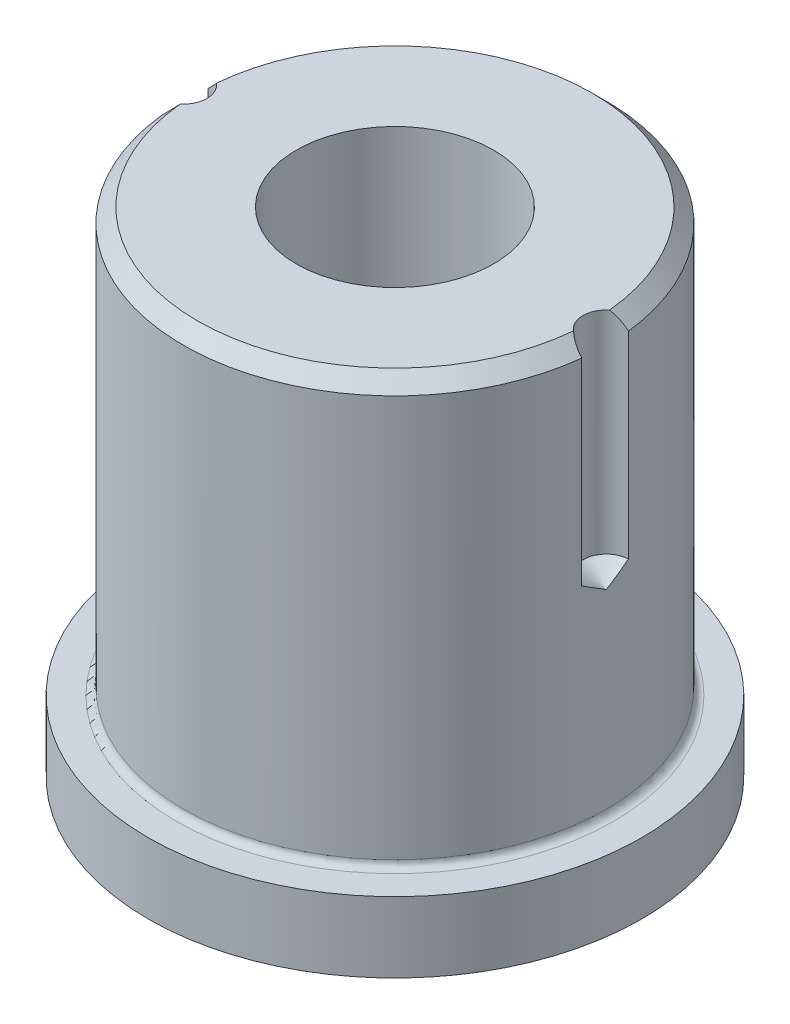
ISO-10303-21;
HEADER;
FILE_DESCRIPTION(('STEP AP214'),'2;1');
FILE_NAME('part.step','',(''),(''),'','','');
FILE_SCHEMA(('AUTOMOTIVE_DESIGN { 1 0 10303 214 1 1 1 1 }'));
ENDSEC;
DATA;
#1=APPLICATION_CONTEXT('core data for automotive mechanical design processes');
#2=APPLICATION_PROTOCOL_DEFINITION('international standard','automotive_design',2000,#1);
#3=PRODUCT_CONTEXT('',#1,'mechanical');
#4=PRODUCT('Part','Part','',(#3));
#5=PRODUCT_RELATED_PRODUCT_CATEGORY('part','',(#4));
#6=PRODUCT_DEFINITION_FORMATION('','',#4);
#7=PRODUCT_DEFINITION_CONTEXT('part definition',#1,'design');
#8=PRODUCT_DEFINITION('design','',#6,#7);
#9=PRODUCT_DEFINITION_SHAPE('','',#8);
#10=(LENGTH_UNIT() NAMED_UNIT(*) SI_UNIT(.MILLI.,.METRE.));
#11=(NAMED_UNIT(*) PLANE_ANGLE_UNIT() SI_UNIT($,.RADIAN.));
#12=(NAMED_UNIT(*) SI_UNIT($,.STERADIAN.) SOLID_ANGLE_UNIT());
#13=UNCERTAINTY_MEASURE_WITH_UNIT(LENGTH_MEASURE(1.E-05),#10,'distance_accuracy_value','');
#14=(GEOMETRIC_REPRESENTATION_CONTEXT(3) GLOBAL_UNCERTAINTY_ASSIGNED_CONTEXT((#13)) GLOBAL_UNIT_ASSIGNED_CONTEXT((#10,
#11,#12)) REPRESENTATION_CONTEXT('',''));
#15=CARTESIAN_POINT('',(0.,0.,0.));
#16=DIRECTION('',(0.,0.,1.));
#17=DIRECTION('',(1.,0.,0.));
#18=AXIS2_PLACEMENT_3D('',#15,#16,#17);
#19=CARTESIAN_POINT('',(0.,70.,0.));
#20=DIRECTION('',(0.,-1.,0.));
#21=DIRECTION('',(0.,0.,-1.));
#22=AXIS2_PLACEMENT_3D('',#19,#20,#21);
#23=CONICAL_SURFACE('',#22,28.,0.785398163397449);
#24=CARTESIAN_POINT('',(-27.8823857965,70.0002,-2.56151563242059));
#25=CARTESIAN_POINT('',(-27.9666342826174,69.9099278444335,-2.63112533099626));
#26=CARTESIAN_POINT('',(-28.0530288174389,69.817803154286,-2.6955939772543));
#27=CARTESIAN_POINT('',(-28.229375578596,69.6307058261305,-2.81458677113417));
#28=CARTESIAN_POINT('',(-28.3193254726496,69.5357350646919,-2.8691173105143));
#29=CARTESIAN_POINT('',(-28.5007594595267,69.3451542777325,-2.96789837780088));
#30=CARTESIAN_POINT('',(-28.5921989798206,69.2495763001557,-3.0122935110216));
#31=CARTESIAN_POINT('',(-28.7774121661541,69.0569583289167,-3.0921035499832));
#32=CARTESIAN_POINT('',(-28.8711860087836,68.9599182248663,-3.12751777404355));
#33=CARTESIAN_POINT('',(-29.1036334486517,68.7205920565148,-3.20361942610116));
#34=CARTESIAN_POINT('',(-29.2433773646598,68.5777508054713,-3.23941088497087));
#35=CARTESIAN_POINT('',(-29.4558002341984,68.3622044180598,-3.2794466830408));
#36=CARTESIAN_POINT('',(-29.5274962764095,68.2897209035279,-3.29054033247472));
#37=CARTESIAN_POINT('',(-29.6714266570494,68.144740728951,-3.30801136738476));
#38=CARTESIAN_POINT('',(-29.7436609163371,68.0722440723106,-3.31438943295072));
#39=CARTESIAN_POINT('',(-29.8161057965,67.9998,-3.31840852999131));
#40=B_SPLINE_CURVE_WITH_KNOTS('',3,(#24,#25,#26,#27,#28,#29,#30,#31,#32,#33,#34,#35,#36,#37,#38,
#39),.UNSPECIFIED.,.F.,.F.,(4,2,2,2,2,2,2,4),(0.,0.42501985144132,0.849765376420141,
1.26800804325003,1.6862824465776,2.29430656871737,2.60187725650856,2.90940357725365),.UNSPECIFIED.);
#41=CARTESIAN_POINT('',(-27.8825724624978,70.,-2.56166993842443));
#42=VERTEX_POINT('',#41);
#43=CARTESIAN_POINT('',(-29.8159057958333,68.,-3.31839744063188));
#44=VERTEX_POINT('',#43);
#45=EDGE_CURVE('E108',#42,#44,#40,.T.);
#46=ORIENTED_EDGE('',*,*,#45,.F.);
#47=CARTESIAN_POINT('',(0.,70.,0.));
#48=DIRECTION('',(0.,1.,0.));
#49=DIRECTION('',(0.,0.,1.));
#50=AXIS2_PLACEMENT_3D('',#47,#48,#49);
#51=CIRCLE('',#50,28.);
#52=CARTESIAN_POINT('',(27.8825724625,70.,-2.56166993842624));
#53=VERTEX_POINT('',#52);
#54=EDGE_CURVE('E243',#53,#42,#51,.T.);
#55=ORIENTED_EDGE('',*,*,#54,.F.);
#56=CARTESIAN_POINT('',(29.8161057965,67.9998,-3.31840852999131));
#57=CARTESIAN_POINT('',(29.6854355013136,68.1304603064894,-3.31112718232559));
#58=CARTESIAN_POINT('',(29.555396634842,68.2613607071781,-3.296216662331));
#59=CARTESIAN_POINT('',(29.2973061848414,68.5228732615235,-3.25102080590179));
#60=CARTESIAN_POINT('',(29.1692580521,68.653484636991,-3.22071130237863));
#61=CARTESIAN_POINT('',(28.9190090561027,68.9104420169217,-3.14544099598424));
#62=CARTESIAN_POINT('',(28.796741669804,69.0368193635887,-3.10080906672239));
#63=CARTESIAN_POINT('',(28.5562738362898,69.2869769668243,-2.99641014421595));
#64=CARTESIAN_POINT('',(28.4380694912131,69.4107596653885,-2.93665814430503));
#65=CARTESIAN_POINT('',(28.2468838836746,69.6122380237416,-2.82487168894004));
#66=CARTESIAN_POINT('',(28.1724238793253,69.6910421039209,-2.77733630783157));
#67=CARTESIAN_POINT('',(28.0255855631046,69.8470792269641,-2.67495466465246));
#68=CARTESIAN_POINT('',(27.953225719272,69.9242971990802,-2.62005903015582));
#69=CARTESIAN_POINT('',(27.8823857965,70.0002,-2.56151563242058));
#70=B_SPLINE_CURVE_WITH_KNOTS('',3,(#56,#57,#58,#59,#60,#61,#62,#63,#64,#65,#66,#67,#68,#69),
.UNSPECIFIED.,.F.,.F.,(4,2,2,2,2,2,4),(0.,0.554676340847374,1.11022588946276,1.65383599408269,
2.19690914321264,2.55181963377219,2.90924257868919),.UNSPECIFIED.);
#71=CARTESIAN_POINT('',(29.8159057958333,68.,-3.31839744063188));
#72=VERTEX_POINT('',#71);
#73=EDGE_CURVE('E193',#72,#53,#70,.T.);
#74=ORIENTED_EDGE('',*,*,#73,.F.);
#75=CARTESIAN_POINT('',(0.,68.,0.));
#76=DIRECTION('',(0.,1.,0.));
#77=DIRECTION('',(0.,0.,1.));
#78=AXIS2_PLACEMENT_3D('',#75,#76,#77);
#79=CIRCLE('',#78,30.);
#80=EDGE_CURVE('E245',#44,#72,#79,.F.);
#81=ORIENTED_EDGE('',*,*,#80,.F.);
#82=EDGE_LOOP('',(#46,#55,#74,#81));
#83=FACE_BOUND('',#82,.T.);
#84=ADVANCED_FACE('F37',(#83),#23,.T.);
#85=CARTESIAN_POINT('',(0.,10.,0.));
#86=DIRECTION('',(0.,-1.,0.));
#87=DIRECTION('',(0.,0.,-1.));
#88=AXIS2_PLACEMENT_3D('',#85,#86,#87);
#89=CYLINDRICAL_SURFACE('',#88,35.);
#90=CARTESIAN_POINT('',(0.,10.,0.));
#91=DIRECTION('',(0.,1.,0.));
#92=DIRECTION('',(0.,0.,1.));
#93=AXIS2_PLACEMENT_3D('',#90,#91,#92);
#94=CIRCLE('',#93,35.);
#95=CARTESIAN_POINT('',(0.,10.,35.));
#96=VERTEX_POINT('',#95);
#97=EDGE_CURVE('E237',#96,#96,#94,.T.);
#98=ORIENTED_EDGE('',*,*,#97,.F.);
#99=EDGE_LOOP('',(#98));
#100=FACE_BOUND('',#99,.T.);
#101=CARTESIAN_POINT('',(0.,0.,0.));
#102=DIRECTION('',(0.,1.,0.));
#103=DIRECTION('',(0.,0.,1.));
#104=AXIS2_PLACEMENT_3D('',#101,#102,#103);
#105=CIRCLE('',#104,35.);
#106=CARTESIAN_POINT('',(0.,0.,35.));
#107=VERTEX_POINT('',#106);
#108=EDGE_CURVE('E234',#107,#107,#105,.T.);
#109=ORIENTED_EDGE('',*,*,#108,.T.);
#110=EDGE_LOOP('',(#109));
#111=FACE_BOUND('',#110,.T.);
#112=ADVANCED_FACE('F178',(#100,#111),#89,.T.);
#113=CARTESIAN_POINT('',(0.,10.,0.));
#114=DIRECTION('',(0.,1.,0.));
#115=DIRECTION('',(0.,0.,1.));
#116=AXIS2_PLACEMENT_3D('',#113,#114,#115);
#117=PLANE('',#116);
#118=CARTESIAN_POINT('',(0.,10.,0.));
#119=DIRECTION('',(0.,1.,0.));
#120=DIRECTION('',(0.,0.,1.));
#121=AXIS2_PLACEMENT_3D('',#118,#119,#120);
#122=CIRCLE('',#121,31.);
#123=CARTESIAN_POINT('',(0.,10.,31.));
#124=VERTEX_POINT('',#123);
#125=EDGE_CURVE('E11',#124,#124,#122,.F.);
#126=ORIENTED_EDGE('',*,*,#125,.T.);
#127=EDGE_LOOP('',(#126));
#128=FACE_BOUND('',#127,.T.);
#129=ORIENTED_EDGE('',*,*,#97,.T.);
#130=EDGE_LOOP('',(#129));
#131=FACE_BOUND('',#130,.T.);
#132=ADVANCED_FACE('F138',(#128,#131),#117,.T.);
#133=CARTESIAN_POINT('',(0.,0.,0.));
#134=DIRECTION('',(0.,1.,0.));
#135=DIRECTION('',(0.,0.,1.));
#136=AXIS2_PLACEMENT_3D('',#133,#134,#135);
#137=PLANE('',#136);
#138=CARTESIAN_POINT('',(0.,0.,0.));
#139=DIRECTION('',(0.,1.,0.));
#140=DIRECTION('',(0.,0.,1.));
#141=AXIS2_PLACEMENT_3D('',#138,#139,#140);
#142=CIRCLE('',#141,14.);
#143=CARTESIAN_POINT('',(0.,0.,14.));
#144=VERTEX_POINT('',#143);
#145=EDGE_CURVE('E231',#144,#144,#142,.T.);
#146=ORIENTED_EDGE('',*,*,#145,.T.);
#147=EDGE_LOOP('',(#146));
#148=FACE_BOUND('',#147,.T.);
#149=ORIENTED_EDGE('',*,*,#108,.F.);
#150=EDGE_LOOP('',(#149));
#151=FACE_BOUND('',#150,.T.);
#152=ADVANCED_FACE('F135',(#148,#151),#137,.F.);
#153=CARTESIAN_POINT('',(0.,70.,0.));
#154=DIRECTION('',(0.,-1.,0.));
#155=DIRECTION('',(0.,0.,-1.));
#156=AXIS2_PLACEMENT_3D('',#153,#154,#155);
#157=CYLINDRICAL_SURFACE('',#156,30.);
#158=CARTESIAN_POINT('',(0.,11.,0.));
#159=DIRECTION('',(0.,1.,0.));
#160=DIRECTION('',(0.,0.,1.));
#161=AXIS2_PLACEMENT_3D('',#158,#159,#160);
#162=CIRCLE('',#161,30.);
#163=CARTESIAN_POINT('',(0.,11.,30.));
#164=VERTEX_POINT('',#163);
#165=EDGE_CURVE('E45',#164,#164,#162,.T.);
#166=ORIENTED_EDGE('',*,*,#165,.T.);
#167=EDGE_LOOP('',(#166));
#168=FACE_BOUND('',#167,.T.);
#169=CARTESIAN_POINT('',(-30.,38.0030397326619,0.));
#170=CARTESIAN_POINT('',(-30.,38.0030434905224,-6.2541301338439E-06));
#171=CARTESIAN_POINT('',(-29.999999999998,38.0030472483829,-1.25082602677286E-05));
#172=CARTESIAN_POINT('',(-29.9999999999584,38.0030853421151,-7.59068771127322E-05));
#173=CARTESIAN_POINT('',(-29.9999999997594,38.0031196779867,-0.000133051363826815));
#174=CARTESIAN_POINT('',(-29.9999999979479,38.003291357345,-0.000418773797406302));
#175=CARTESIAN_POINT('',(-29.9999999938864,38.0034287008316,-0.000647351744260842));
#176=CARTESIAN_POINT('',(-29.9999999605167,38.0041154182653,-0.00179024147880636));
#177=CARTESIAN_POINT('',(-29.9999998920225,38.0046647922126,-0.00270455326533418));
#178=CARTESIAN_POINT('',(-29.9999993405613,38.0074116619641,-0.00727611222367603));
#179=CARTESIAN_POINT('',(-29.9999982306234,38.0096091577379,-0.0109333593462401));
#180=CARTESIAN_POINT('',(-29.9999893370217,38.0205966381789,-0.0292195962327262));
#181=CARTESIAN_POINT('',(-29.9999715216222,38.0293866227021,-0.0438485817308379));
#182=CARTESIAN_POINT('',(-29.9998289442556,38.0733366422799,-0.116993592627706));
#183=CARTESIAN_POINT('',(-29.9995436811814,38.1084966572377,-0.175509350682127));
#184=CARTESIAN_POINT('',(-29.9972611849246,38.2843029469066,-0.468093476179086));
#185=CARTESIAN_POINT('',(-29.9926954090206,38.4249479590773,-0.702144717427878));
#186=CARTESIAN_POINT('',(-29.9561512818596,39.1285721629939,-1.87274429092063));
#187=CARTESIAN_POINT('',(-29.8830271752968,39.6914703301157,-2.80819424255269));
#188=CARTESIAN_POINT('',(-29.7660917063095,40.2540225325543,-3.73895500528846));
#189=B_SPLINE_CURVE_WITH_KNOTS('',3,(#169,#170,#171,#172,#173,#174,#175,#176,#177,#178,#179,
#180,#181,#182,#183,#184,#185,#186,#187,#188),.UNSPECIFIED.,.F.,.F.,(4,2,2,2,2,2,2,2,2,4),(0.,
2.18888312549756E-05,0.00022188883125289,0.00102188883128897,0.00422188883374516,
0.0170218889909837,0.068221899054278,0.273022543113063,1.09226377108666,4.37171080703242),.UNSPECIFIED.);
#190=CARTESIAN_POINT('',(-30.,38.0030397326619,0.));
#191=VERTEX_POINT('',#190);
#192=CARTESIAN_POINT('',(-29.8159057958333,40.,-3.31839744063188));
#193=VERTEX_POINT('',#192);
#194=EDGE_CURVE('E98',#191,#193,#189,.T.);
#195=ORIENTED_EDGE('',*,*,#194,.T.);
#196=DIRECTION('',(0.,1.,0.));
#197=VECTOR('',#196,1.);
#198=CARTESIAN_POINT('',(-29.8159057958333,55.,-3.31839744063188));
#199=LINE('',#198,#197);
#200=EDGE_CURVE('E218',#193,#44,#199,.T.);
#201=ORIENTED_EDGE('',*,*,#200,.T.);
#202=ORIENTED_EDGE('',*,*,#80,.T.);
#203=DIRECTION('',(0.,1.,0.));
#204=VECTOR('',#203,1.);
#205=CARTESIAN_POINT('',(29.8159057958333,55.,-3.31839744063188));
#206=LINE('',#205,#204);
#207=CARTESIAN_POINT('',(29.8159057958333,40.,-3.31839744063188));
#208=VERTEX_POINT('',#207);
#209=EDGE_CURVE('E157',#72,#208,#206,.F.);
#210=ORIENTED_EDGE('',*,*,#209,.T.);
#211=CARTESIAN_POINT('',(30.,38.0030397326619,0.));
#212=CARTESIAN_POINT('',(30.,38.0030434905224,-6.2541301338439E-06));
#213=CARTESIAN_POINT('',(29.999999999998,38.0030472483829,-1.25082602677286E-05));
#214=CARTESIAN_POINT('',(29.9999999999584,38.0030853421151,-7.59068771127322E-05));
#215=CARTESIAN_POINT('',(29.9999999997594,38.0031196779867,-0.000133051363826815));
#216=CARTESIAN_POINT('',(29.9999999979479,38.003291357345,-0.000418773797406302));
#217=CARTESIAN_POINT('',(29.9999999938864,38.0034287008316,-0.000647351744260842));
#218=CARTESIAN_POINT('',(29.9999999605167,38.0041154182653,-0.00179024147880636));
#219=CARTESIAN_POINT('',(29.9999998920225,38.0046647922126,-0.00270455326533418));
#220=CARTESIAN_POINT('',(29.9999993405613,38.0074116619641,-0.00727611222367603));
#221=CARTESIAN_POINT('',(29.9999982306234,38.0096091577379,-0.0109333593462401));
#222=CARTESIAN_POINT('',(29.9999893370217,38.0205966381789,-0.0292195962327262));
#223=CARTESIAN_POINT('',(29.9999715216222,38.0293866227021,-0.0438485817308379));
#224=CARTESIAN_POINT('',(29.9998289442556,38.0733366422799,-0.116993592627706));
#225=CARTESIAN_POINT('',(29.9995436811814,38.1084966572377,-0.175509350682127));
#226=CARTESIAN_POINT('',(29.9972611849246,38.2843029469066,-0.468093476179086));
#227=CARTESIAN_POINT('',(29.9926954090206,38.4249479590773,-0.702144717427878));
#228=CARTESIAN_POINT('',(29.9561512818596,39.1285721629939,-1.87274429092063));
#229=CARTESIAN_POINT('',(29.8830271752968,39.6914703301157,-2.80819424255269));
#230=CARTESIAN_POINT('',(29.7660917063095,40.2540225325543,-3.73895500528846));
#231=B_SPLINE_CURVE_WITH_KNOTS('',3,(#211,#212,#213,#214,#215,#216,#217,#218,#219,#220,#221,
#222,#223,#224,#225,#226,#227,#228,#229,#230),.UNSPECIFIED.,.F.,.F.,(4,2,2,2,2,2,2,2,2,4),(0.,
2.18888312549756E-05,0.00022188883125289,0.00102188883128897,0.00422188883374516,
0.0170218889909837,0.068221899054278,0.273022543113063,1.09226377108666,4.37171080703242),.UNSPECIFIED.);
#232=CARTESIAN_POINT('',(30.,38.0030397326619,0.));
#233=VERTEX_POINT('',#232);
#234=EDGE_CURVE('E143',#208,#233,#231,.F.);
#235=ORIENTED_EDGE('',*,*,#234,.T.);
#236=CARTESIAN_POINT('',(30.,38.0030397326619,0.));
#237=CARTESIAN_POINT('',(30.,38.0030434905224,6.2541301338439E-06));
#238=CARTESIAN_POINT('',(29.999999999998,38.0030472483829,1.25082602677286E-05));
#239=CARTESIAN_POINT('',(29.9999999999584,38.0030853421151,7.59068771127322E-05));
#240=CARTESIAN_POINT('',(29.9999999997594,38.0031196779867,0.000133051363826815));
#241=CARTESIAN_POINT('',(29.9999999979479,38.003291357345,0.000418773797406302));
#242=CARTESIAN_POINT('',(29.9999999938864,38.0034287008316,0.000647351744260842));
#243=CARTESIAN_POINT('',(29.9999999605167,38.0041154182653,0.00179024147880636));
#244=CARTESIAN_POINT('',(29.9999998920225,38.0046647922126,0.00270455326533418));
#245=CARTESIAN_POINT('',(29.9999993405613,38.0074116619641,0.00727611222367603));
#246=CARTESIAN_POINT('',(29.9999982306234,38.0096091577379,0.0109333593462401));
#247=CARTESIAN_POINT('',(29.9999893370217,38.0205966381789,0.0292195962327262));
#248=CARTESIAN_POINT('',(29.9999715216222,38.0293866227021,0.0438485817308379));
#249=CARTESIAN_POINT('',(29.9998289442556,38.0733366422799,0.116993592627706));
#250=CARTESIAN_POINT('',(29.9995436811814,38.1084966572377,0.175509350682127));
#251=CARTESIAN_POINT('',(29.9972611849246,38.2843029469066,0.468093476179086));
#252=CARTESIAN_POINT('',(29.9926954090206,38.4249479590773,0.702144717427878));
#253=CARTESIAN_POINT('',(29.9561512818596,39.1285721629939,1.87274429092063));
#254=CARTESIAN_POINT('',(29.8830271752968,39.6914703301157,2.80819424255269));
#255=CARTESIAN_POINT('',(29.7660917063095,40.2540225325543,3.73895500528846));
#256=B_SPLINE_CURVE_WITH_KNOTS('',3,(#236,#237,#238,#239,#240,#241,#242,#243,#244,#245,#246,
#247,#248,#249,#250,#251,#252,#253,#254,#255),.UNSPECIFIED.,.F.,.F.,(4,2,2,2,2,2,2,2,2,4),(0.,
2.18888312549756E-05,0.00022188883125289,0.00102188883128897,0.00422188883374516,
0.0170218889909837,0.068221899054278,0.273022543113063,1.09226377108666,4.37171080703242),.UNSPECIFIED.);
#257=CARTESIAN_POINT('',(29.8159057958333,40.,3.31839744063188));
#258=VERTEX_POINT('',#257);
#259=EDGE_CURVE('E60',#233,#258,#256,.T.);
#260=ORIENTED_EDGE('',*,*,#259,.T.);
#261=DIRECTION('',(0.,1.,0.));
#262=VECTOR('',#261,1.);
#263=CARTESIAN_POINT('',(29.8159057958333,55.,3.31839744063188));
#264=LINE('',#263,#262);
#265=CARTESIAN_POINT('',(29.8159057958333,68.,3.31839744063188));
#266=VERTEX_POINT('',#265);
#267=EDGE_CURVE('E256',#258,#266,#264,.T.);
#268=ORIENTED_EDGE('',*,*,#267,.T.);
#269=CARTESIAN_POINT('',(-29.8159057958333,68.,3.31839744063188));
#270=VERTEX_POINT('',#269);
#271=EDGE_CURVE('E246',#266,#270,#79,.F.);
#272=ORIENTED_EDGE('',*,*,#271,.T.);
#273=DIRECTION('',(0.,1.,0.));
#274=VECTOR('',#273,1.);
#275=CARTESIAN_POINT('',(-29.8159057958333,55.,3.31839744063188));
#276=LINE('',#275,#274);
#277=CARTESIAN_POINT('',(-29.8159057958333,40.,3.31839744063188));
#278=VERTEX_POINT('',#277);
#279=EDGE_CURVE('E52',#270,#278,#276,.F.);
#280=ORIENTED_EDGE('',*,*,#279,.T.);
#281=CARTESIAN_POINT('',(-30.,38.0030397326619,0.));
#282=CARTESIAN_POINT('',(-30.,38.0030434905224,6.2541301338439E-06));
#283=CARTESIAN_POINT('',(-29.999999999998,38.0030472483829,1.25082602677286E-05));
#284=CARTESIAN_POINT('',(-29.9999999999584,38.0030853421151,7.59068771127322E-05));
#285=CARTESIAN_POINT('',(-29.9999999997594,38.0031196779867,0.000133051363826815));
#286=CARTESIAN_POINT('',(-29.9999999979479,38.003291357345,0.000418773797406302));
#287=CARTESIAN_POINT('',(-29.9999999938864,38.0034287008316,0.000647351744260842));
#288=CARTESIAN_POINT('',(-29.9999999605167,38.0041154182653,0.00179024147880636));
#289=CARTESIAN_POINT('',(-29.9999998920225,38.0046647922126,0.00270455326533418));
#290=CARTESIAN_POINT('',(-29.9999993405613,38.0074116619641,0.00727611222367603));
#291=CARTESIAN_POINT('',(-29.9999982306234,38.0096091577379,0.0109333593462401));
#292=CARTESIAN_POINT('',(-29.9999893370217,38.0205966381789,0.0292195962327262));
#293=CARTESIAN_POINT('',(-29.9999715216222,38.0293866227021,0.0438485817308379));
#294=CARTESIAN_POINT('',(-29.9998289442556,38.0733366422799,0.116993592627706));
#295=CARTESIAN_POINT('',(-29.9995436811814,38.1084966572377,0.175509350682127));
#296=CARTESIAN_POINT('',(-29.9972611849246,38.2843029469066,0.468093476179086));
#297=CARTESIAN_POINT('',(-29.9926954090206,38.4249479590773,0.702144717427878));
#298=CARTESIAN_POINT('',(-29.9561512818596,39.1285721629939,1.87274429092063));
#299=CARTESIAN_POINT('',(-29.8830271752968,39.6914703301157,2.80819424255269));
#300=CARTESIAN_POINT('',(-29.7660917063095,40.2540225325543,3.73895500528846));
#301=B_SPLINE_CURVE_WITH_KNOTS('',3,(#281,#282,#283,#284,#285,#286,#287,#288,#289,#290,#291,
#292,#293,#294,#295,#296,#297,#298,#299,#300),.UNSPECIFIED.,.F.,.F.,(4,2,2,2,2,2,2,2,2,4),(0.,
2.18888312549756E-05,0.00022188883125289,0.00102188883128897,0.00422188883374516,
0.0170218889909837,0.068221899054278,0.273022543113063,1.09226377108666,4.37171080703242),.UNSPECIFIED.);
#302=EDGE_CURVE('E101',#278,#191,#301,.F.);
#303=ORIENTED_EDGE('',*,*,#302,.T.);
#304=EDGE_LOOP('',(#195,#201,#202,#210,#235,#260,#268,#272,#280,#303));
#305=FACE_BOUND('',#304,.T.);
#306=ADVANCED_FACE('F106',(#168,#305),#157,.T.);
#307=CARTESIAN_POINT('',(0.,70.,0.));
#308=DIRECTION('',(0.,1.,0.));
#309=DIRECTION('',(0.,0.,1.));
#310=AXIS2_PLACEMENT_3D('',#307,#308,#309);
#311=PLANE('',#310);
#312=CARTESIAN_POINT('',(-30.,70.,0.));
#313=DIRECTION('',(0.,1.,0.));
#314=DIRECTION('',(0.,0.,1.));
#315=AXIS2_PLACEMENT_3D('',#312,#313,#314);
#316=CIRCLE('',#315,3.3235);
#317=CARTESIAN_POINT('',(-27.8825724625,70.,2.56166993842624));
#318=VERTEX_POINT('',#317);
#319=EDGE_CURVE('E219',#318,#42,#316,.T.);
#320=ORIENTED_EDGE('',*,*,#319,.F.);
#321=CARTESIAN_POINT('',(27.8825724624978,70.,2.56166993842442));
#322=VERTEX_POINT('',#321);
#323=EDGE_CURVE('E240',#318,#322,#51,.T.);
#324=ORIENTED_EDGE('',*,*,#323,.T.);
#325=CARTESIAN_POINT('',(30.,70.,0.));
#326=DIRECTION('',(0.,1.,0.));
#327=DIRECTION('',(0.,0.,1.));
#328=AXIS2_PLACEMENT_3D('',#325,#326,#327);
#329=CIRCLE('',#328,3.32349999999999);
#330=EDGE_CURVE('E225',#53,#322,#329,.T.);
#331=ORIENTED_EDGE('',*,*,#330,.F.);
#332=ORIENTED_EDGE('',*,*,#54,.T.);
#333=EDGE_LOOP('',(#320,#324,#331,#332));
#334=FACE_BOUND('',#333,.T.);
#335=CARTESIAN_POINT('',(0.,70.,0.));
#336=DIRECTION('',(0.,1.,0.));
#337=DIRECTION('',(0.,0.,1.));
#338=AXIS2_PLACEMENT_3D('',#335,#336,#337);
#339=CIRCLE('',#338,14.);
#340=CARTESIAN_POINT('',(0.,70.,14.));
#341=VERTEX_POINT('',#340);
#342=EDGE_CURVE('E230',#341,#341,#339,.T.);
#343=ORIENTED_EDGE('',*,*,#342,.F.);
#344=EDGE_LOOP('',(#343));
#345=FACE_BOUND('',#344,.T.);
#346=ADVANCED_FACE('F134',(#334,#345),#311,.T.);
#347=CARTESIAN_POINT('',(0.,0.,0.));
#348=DIRECTION('',(0.,1.,0.));
#349=DIRECTION('',(0.,0.,1.));
#350=AXIS2_PLACEMENT_3D('',#347,#348,#349);
#351=CYLINDRICAL_SURFACE('',#350,14.);
#352=ORIENTED_EDGE('',*,*,#145,.F.);
#353=EDGE_LOOP('',(#352));
#354=FACE_BOUND('',#353,.T.);
#355=ORIENTED_EDGE('',*,*,#342,.T.);
#356=EDGE_LOOP('',(#355));
#357=FACE_BOUND('',#356,.T.);
#358=ADVANCED_FACE('F164',(#354,#357),#351,.F.);
#359=CARTESIAN_POINT('',(-29.8161057965,67.9998,3.31840852999131));
#360=CARTESIAN_POINT('',(-29.6854355013136,68.1304603064894,3.3111271823256));
#361=CARTESIAN_POINT('',(-29.555396634842,68.2613607071781,3.296216662331));
#362=CARTESIAN_POINT('',(-29.2973061848414,68.5228732615235,3.25102080590179));
#363=CARTESIAN_POINT('',(-29.1692580521,68.653484636991,3.22071130237863));
#364=CARTESIAN_POINT('',(-28.9190090561027,68.9104420169217,3.14544099598424));
#365=CARTESIAN_POINT('',(-28.7967416698039,69.0368193635887,3.10080906672239));
#366=CARTESIAN_POINT('',(-28.5562738362898,69.2869769668243,2.99641014421595));
#367=CARTESIAN_POINT('',(-28.4380694912131,69.4107596653885,2.93665814430503));
#368=CARTESIAN_POINT('',(-28.2468838836746,69.6122380237416,2.82487168894004));
#369=CARTESIAN_POINT('',(-28.1724238793253,69.6910421039209,2.77733630783157));
#370=CARTESIAN_POINT('',(-28.0255855631046,69.8470792269641,2.67495466465245));
#371=CARTESIAN_POINT('',(-27.953225719272,69.9242971990802,2.62005903015582));
#372=CARTESIAN_POINT('',(-27.8823857965,70.0002,2.56151563242059));
#373=B_SPLINE_CURVE_WITH_KNOTS('',3,(#359,#360,#361,#362,#363,#364,#365,#366,#367,#368,#369,
#370,#371,#372),.UNSPECIFIED.,.F.,.F.,(4,2,2,2,2,2,4),(0.,0.554676340847374,1.11022588946276,
1.65383599408271,2.19690914321265,2.5518196337722,2.90924257868919),.UNSPECIFIED.);
#374=EDGE_CURVE('E110',#270,#318,#373,.T.);
#375=ORIENTED_EDGE('',*,*,#374,.F.);
#376=ORIENTED_EDGE('',*,*,#271,.F.);
#377=CARTESIAN_POINT('',(27.8823857965,70.0002,2.56151563242059));
#378=CARTESIAN_POINT('',(27.9666342826174,69.9099278444335,2.63112533099625));
#379=CARTESIAN_POINT('',(28.0530288174389,69.817803154286,2.6955939772543));
#380=CARTESIAN_POINT('',(28.229375578596,69.6307058261305,2.81458677113417));
#381=CARTESIAN_POINT('',(28.3193254726496,69.5357350646919,2.86911731051429));
#382=CARTESIAN_POINT('',(28.5007594595267,69.3451542777325,2.96789837780088));
#383=CARTESIAN_POINT('',(28.5921989798206,69.2495763001557,3.0122935110216));
#384=CARTESIAN_POINT('',(28.7774121661541,69.0569583289167,3.0921035499832));
#385=CARTESIAN_POINT('',(28.8711860087836,68.9599182248663,3.12751777404355));
#386=CARTESIAN_POINT('',(29.1036334486517,68.7205920565148,3.20361942610116));
#387=CARTESIAN_POINT('',(29.2433773646598,68.5777508054713,3.23941088497087));
#388=CARTESIAN_POINT('',(29.4558002341984,68.3622044180598,3.2794466830408));
#389=CARTESIAN_POINT('',(29.5274962764095,68.2897209035279,3.29054033247472));
#390=CARTESIAN_POINT('',(29.6714266570494,68.144740728951,3.30801136738475));
#391=CARTESIAN_POINT('',(29.7436609163371,68.0722440723106,3.31438943295071));
#392=CARTESIAN_POINT('',(29.8161057965,67.9998,3.31840852999131));
#393=B_SPLINE_CURVE_WITH_KNOTS('',3,(#377,#378,#379,#380,#381,#382,#383,#384,#385,#386,#387,
#388,#389,#390,#391,#392),.UNSPECIFIED.,.F.,.F.,(4,2,2,2,2,2,2,4),(0.,0.425019851441305,
0.849765376420141,1.26800804325003,1.6862824465776,2.29430656871737,2.60187725650856,
2.90940357725365),.UNSPECIFIED.);
#394=EDGE_CURVE('E200',#322,#266,#393,.T.);
#395=ORIENTED_EDGE('',*,*,#394,.F.);
#396=ORIENTED_EDGE('',*,*,#323,.F.);
#397=EDGE_LOOP('',(#375,#376,#395,#396));
#398=FACE_BOUND('',#397,.T.);
#399=ADVANCED_FACE('F167',(#398),#23,.T.);
#400=CARTESIAN_POINT('',(30.,70.,0.));
#401=DIRECTION('',(0.,1.,0.));
#402=DIRECTION('',(0.,0.,1.));
#403=AXIS2_PLACEMENT_3D('',#400,#401,#402);
#404=CYLINDRICAL_SURFACE('',#403,3.32349999999999);
#405=CARTESIAN_POINT('',(30.,40.,0.));
#406=DIRECTION('',(0.,1.,0.));
#407=DIRECTION('',(0.,0.,1.));
#408=AXIS2_PLACEMENT_3D('',#405,#406,#407);
#409=CIRCLE('',#408,3.32349999999999);
#410=EDGE_CURVE('E228',#208,#258,#409,.T.);
#411=ORIENTED_EDGE('',*,*,#410,.F.);
#412=ORIENTED_EDGE('',*,*,#209,.F.);
#413=ORIENTED_EDGE('',*,*,#73,.T.);
#414=ORIENTED_EDGE('',*,*,#330,.T.);
#415=ORIENTED_EDGE('',*,*,#394,.T.);
#416=ORIENTED_EDGE('',*,*,#267,.F.);
#417=EDGE_LOOP('',(#411,#412,#413,#414,#415,#416));
#418=FACE_BOUND('',#417,.T.);
#419=ADVANCED_FACE('F162',(#418),#404,.F.);
#420=CARTESIAN_POINT('',(30.,40.,0.));
#421=DIRECTION('',(0.,1.,0.));
#422=DIRECTION('',(0.,0.,1.));
#423=AXIS2_PLACEMENT_3D('',#420,#421,#422);
#424=CONICAL_SURFACE('',#423,3.32349999999999,1.02974425867665);
#425=ORIENTED_EDGE('',*,*,#234,.F.);
#426=ORIENTED_EDGE('',*,*,#410,.T.);
#427=ORIENTED_EDGE('',*,*,#259,.F.);
#428=EDGE_LOOP('',(#425,#426,#427));
#429=FACE_BOUND('',#428,.T.);
#430=ADVANCED_FACE('F159',(#429),#424,.F.);
#431=CARTESIAN_POINT('',(-30.,40.,0.));
#432=DIRECTION('',(0.,1.,0.));
#433=DIRECTION('',(0.,0.,1.));
#434=AXIS2_PLACEMENT_3D('',#431,#432,#433);
#435=CONICAL_SURFACE('',#434,3.32349999999999,1.02974425867665);
#436=ORIENTED_EDGE('',*,*,#302,.F.);
#437=CARTESIAN_POINT('',(-30.,40.,0.));
#438=DIRECTION('',(0.,1.,0.));
#439=DIRECTION('',(0.,0.,1.));
#440=AXIS2_PLACEMENT_3D('',#437,#438,#439);
#441=CIRCLE('',#440,3.32349999999999);
#442=EDGE_CURVE('E102',#278,#193,#441,.T.);
#443=ORIENTED_EDGE('',*,*,#442,.T.);
#444=ORIENTED_EDGE('',*,*,#194,.F.);
#445=EDGE_LOOP('',(#436,#443,#444));
#446=FACE_BOUND('',#445,.T.);
#447=ADVANCED_FACE('F100',(#446),#435,.F.);
#448=CARTESIAN_POINT('',(-30.,70.,0.));
#449=DIRECTION('',(0.,1.,0.));
#450=DIRECTION('',(0.,0.,1.));
#451=AXIS2_PLACEMENT_3D('',#448,#449,#450);
#452=CYLINDRICAL_SURFACE('',#451,3.32349999999999);
#453=ORIENTED_EDGE('',*,*,#442,.F.);
#454=ORIENTED_EDGE('',*,*,#279,.F.);
#455=ORIENTED_EDGE('',*,*,#374,.T.);
#456=ORIENTED_EDGE('',*,*,#319,.T.);
#457=ORIENTED_EDGE('',*,*,#45,.T.);
#458=ORIENTED_EDGE('',*,*,#200,.F.);
#459=EDGE_LOOP('',(#453,#454,#455,#456,#457,#458));
#460=FACE_BOUND('',#459,.T.);
#461=ADVANCED_FACE('F209',(#460),#452,.F.);
#462=CARTESIAN_POINT('',(0.,11.,0.));
#463=DIRECTION('',(0.,1.,0.));
#464=DIRECTION('',(0.,0.,1.));
#465=AXIS2_PLACEMENT_3D('',#462,#463,#464);
#466=TOROIDAL_SURFACE('',#465,31.,1.);
#467=ORIENTED_EDGE('',*,*,#125,.F.);
#468=EDGE_LOOP('',(#467));
#469=FACE_BOUND('',#468,.T.);
#470=ORIENTED_EDGE('',*,*,#165,.F.);
#471=EDGE_LOOP('',(#470));
#472=FACE_BOUND('',#471,.T.);
#473=ADVANCED_FACE('F39',(#469,#472),#466,.F.);
#474=CLOSED_SHELL('',(#84,#112,#132,#152,#306,#346,#358,#399,#419,#430,#447,#461,#473));
#475=MANIFOLD_SOLID_BREP('B2',#474);
#476=ADVANCED_BREP_SHAPE_REPRESENTATION('',(#18,#475),#14);
#477=SHAPE_DEFINITION_REPRESENTATION(#9,#476);
ENDSEC;
END-ISO-10303-21;
